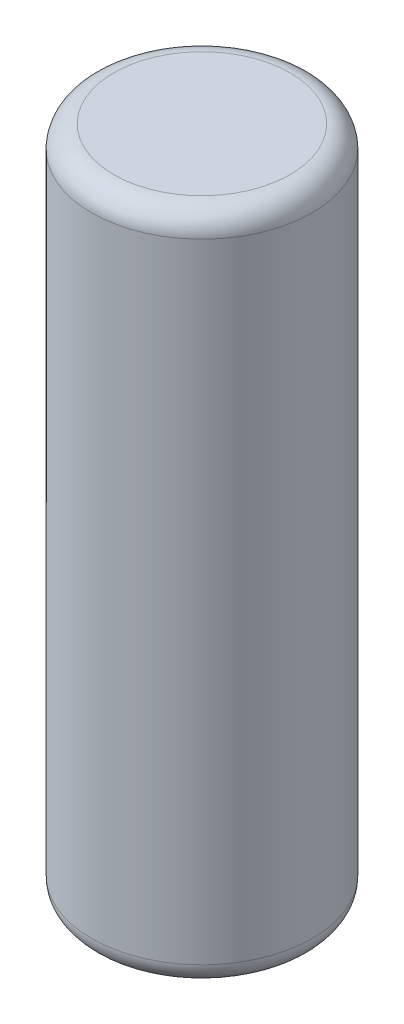
ISO-10303-21;
HEADER;
FILE_DESCRIPTION(('STEP AP214'),'2;1');
FILE_NAME('part.step','',(''),(''),'','','');
FILE_SCHEMA(('AUTOMOTIVE_DESIGN { 1 0 10303 214 1 1 1 1 }'));
ENDSEC;
DATA;
#1=APPLICATION_CONTEXT('core data for automotive mechanical design processes');
#2=APPLICATION_PROTOCOL_DEFINITION('international standard','automotive_design',2000,#1);
#3=PRODUCT_CONTEXT('',#1,'mechanical');
#4=PRODUCT('Part','Part','',(#3));
#5=PRODUCT_RELATED_PRODUCT_CATEGORY('part','',(#4));
#6=PRODUCT_DEFINITION_FORMATION('','',#4);
#7=PRODUCT_DEFINITION_CONTEXT('part definition',#1,'design');
#8=PRODUCT_DEFINITION('design','',#6,#7);
#9=PRODUCT_DEFINITION_SHAPE('','',#8);
#10=(LENGTH_UNIT() NAMED_UNIT(*) SI_UNIT(.MILLI.,.METRE.));
#11=(NAMED_UNIT(*) PLANE_ANGLE_UNIT() SI_UNIT($,.RADIAN.));
#12=(NAMED_UNIT(*) SI_UNIT($,.STERADIAN.) SOLID_ANGLE_UNIT());
#13=UNCERTAINTY_MEASURE_WITH_UNIT(LENGTH_MEASURE(1.E-05),#10,'distance_accuracy_value','');
#14=(GEOMETRIC_REPRESENTATION_CONTEXT(3) GLOBAL_UNCERTAINTY_ASSIGNED_CONTEXT((#13)) GLOBAL_UNIT_ASSIGNED_CONTEXT((#10,
#11,#12)) REPRESENTATION_CONTEXT('',''));
#15=CARTESIAN_POINT('',(0.,0.,0.));
#16=DIRECTION('',(0.,0.,1.));
#17=DIRECTION('',(1.,0.,0.));
#18=AXIS2_PLACEMENT_3D('',#15,#16,#17);
#19=CARTESIAN_POINT('',(0.,61.,0.));
#20=DIRECTION('',(0.,-1.,0.));
#21=DIRECTION('',(0.,0.,-1.));
#22=AXIS2_PLACEMENT_3D('',#19,#20,#21);
#23=CYLINDRICAL_SURFACE('',#22,10.);
#24=CARTESIAN_POINT('',(0.,2.,0.));
#25=DIRECTION('',(0.,1.,0.));
#26=DIRECTION('',(0.,0.,1.));
#27=AXIS2_PLACEMENT_3D('',#24,#25,#26);
#28=CIRCLE('',#27,10.);
#29=CARTESIAN_POINT('',(0.,2.,10.));
#30=VERTEX_POINT('',#29);
#31=EDGE_CURVE('E42',#30,#30,#28,.T.);
#32=ORIENTED_EDGE('',*,*,#31,.T.);
#33=EDGE_LOOP('',(#32));
#34=FACE_BOUND('',#33,.T.);
#35=CARTESIAN_POINT('',(0.,59.,0.));
#36=DIRECTION('',(0.,1.,0.));
#37=DIRECTION('',(0.,0.,1.));
#38=AXIS2_PLACEMENT_3D('',#35,#36,#37);
#39=CIRCLE('',#38,10.);
#40=CARTESIAN_POINT('',(0.,59.,10.));
#41=VERTEX_POINT('',#40);
#42=EDGE_CURVE('E46',#41,#41,#39,.F.);
#43=ORIENTED_EDGE('',*,*,#42,.T.);
#44=EDGE_LOOP('',(#43));
#45=FACE_BOUND('',#44,.T.);
#46=ADVANCED_FACE('F31',(#34,#45),#23,.T.);
#47=CARTESIAN_POINT('',(0.,61.,0.));
#48=DIRECTION('',(0.,1.,0.));
#49=DIRECTION('',(0.,0.,1.));
#50=AXIS2_PLACEMENT_3D('',#47,#48,#49);
#51=PLANE('',#50);
#52=CARTESIAN_POINT('',(0.,61.,0.));
#53=DIRECTION('',(0.,1.,0.));
#54=DIRECTION('',(0.,0.,1.));
#55=AXIS2_PLACEMENT_3D('',#52,#53,#54);
#56=CIRCLE('',#55,8.);
#57=CARTESIAN_POINT('',(0.,61.,8.));
#58=VERTEX_POINT('',#57);
#59=EDGE_CURVE('E10',#58,#58,#56,.T.);
#60=ORIENTED_EDGE('',*,*,#59,.T.);
#61=EDGE_LOOP('',(#60));
#62=FACE_BOUND('',#61,.T.);
#63=ADVANCED_FACE('F62',(#62),#51,.T.);
#64=CARTESIAN_POINT('',(0.,0.,0.));
#65=DIRECTION('',(0.,1.,0.));
#66=DIRECTION('',(0.,0.,1.));
#67=AXIS2_PLACEMENT_3D('',#64,#65,#66);
#68=PLANE('',#67);
#69=CARTESIAN_POINT('',(0.,0.,0.));
#70=DIRECTION('',(0.,1.,0.));
#71=DIRECTION('',(0.,0.,1.));
#72=AXIS2_PLACEMENT_3D('',#69,#70,#71);
#73=CIRCLE('',#72,8.);
#74=CARTESIAN_POINT('',(0.,0.,8.));
#75=VERTEX_POINT('',#74);
#76=EDGE_CURVE('E38',#75,#75,#73,.F.);
#77=ORIENTED_EDGE('',*,*,#76,.T.);
#78=EDGE_LOOP('',(#77));
#79=FACE_BOUND('',#78,.T.);
#80=ADVANCED_FACE('F59',(#79),#68,.F.);
#81=CARTESIAN_POINT('',(0.,2.,0.));
#82=DIRECTION('',(0.,1.,0.));
#83=DIRECTION('',(0.,0.,1.));
#84=AXIS2_PLACEMENT_3D('',#81,#82,#83);
#85=TOROIDAL_SURFACE('',#84,8.,2.);
#86=ORIENTED_EDGE('',*,*,#76,.F.);
#87=EDGE_LOOP('',(#86));
#88=FACE_BOUND('',#87,.T.);
#89=ORIENTED_EDGE('',*,*,#31,.F.);
#90=EDGE_LOOP('',(#89));
#91=FACE_BOUND('',#90,.T.);
#92=ADVANCED_FACE('F55',(#88,#91),#85,.T.);
#93=CARTESIAN_POINT('',(0.,59.,0.));
#94=DIRECTION('',(0.,1.,0.));
#95=DIRECTION('',(0.,0.,1.));
#96=AXIS2_PLACEMENT_3D('',#93,#94,#95);
#97=TOROIDAL_SURFACE('',#96,8.,2.);
#98=ORIENTED_EDGE('',*,*,#42,.F.);
#99=EDGE_LOOP('',(#98));
#100=FACE_BOUND('',#99,.T.);
#101=ORIENTED_EDGE('',*,*,#59,.F.);
#102=EDGE_LOOP('',(#101));
#103=FACE_BOUND('',#102,.T.);
#104=ADVANCED_FACE('F33',(#100,#103),#97,.T.);
#105=CLOSED_SHELL('',(#46,#63,#80,#92,#104));
#106=MANIFOLD_SOLID_BREP('B2',#105);
#107=ADVANCED_BREP_SHAPE_REPRESENTATION('',(#18,#106),#14);
#108=SHAPE_DEFINITION_REPRESENTATION(#9,#107);
ENDSEC;
END-ISO-10303-21;
